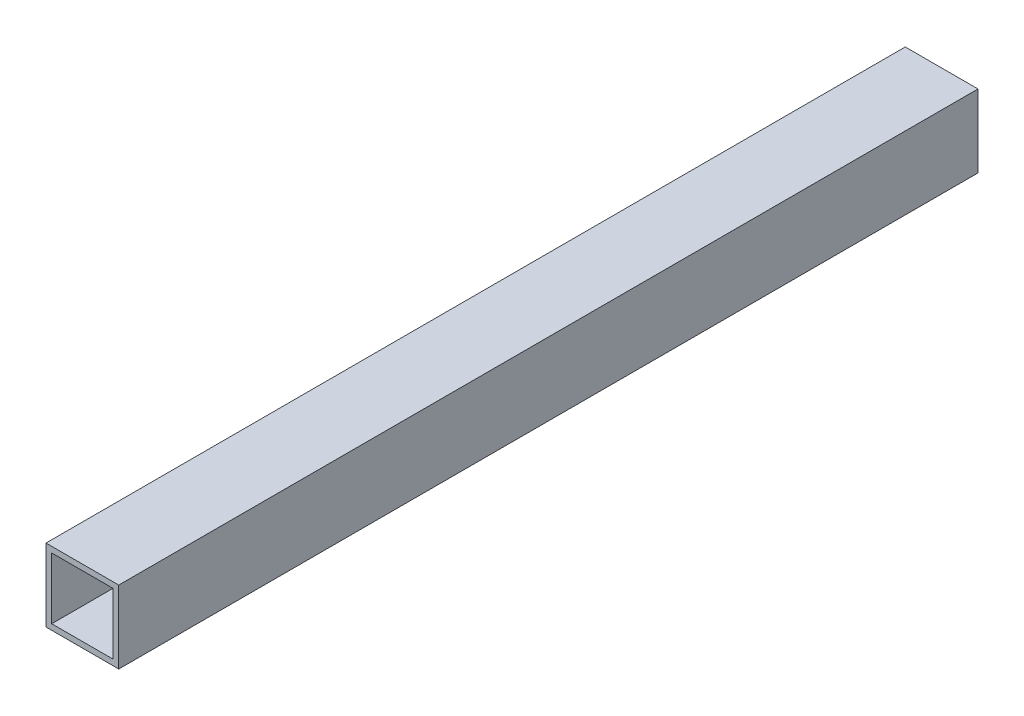
ISO-10303-21;
HEADER;
FILE_DESCRIPTION(('STEP AP214'),'2;1');
FILE_NAME('part.step','',(''),(''),'','','');
FILE_SCHEMA(('AUTOMOTIVE_DESIGN { 1 0 10303 214 1 1 1 1 }'));
ENDSEC;
DATA;
#1=APPLICATION_CONTEXT('core data for automotive mechanical design processes');
#2=APPLICATION_PROTOCOL_DEFINITION('international standard','automotive_design',2000,#1);
#3=PRODUCT_CONTEXT('',#1,'mechanical');
#4=PRODUCT('Part','Part','',(#3));
#5=PRODUCT_RELATED_PRODUCT_CATEGORY('part','',(#4));
#6=PRODUCT_DEFINITION_FORMATION('','',#4);
#7=PRODUCT_DEFINITION_CONTEXT('part definition',#1,'design');
#8=PRODUCT_DEFINITION('design','',#6,#7);
#9=PRODUCT_DEFINITION_SHAPE('','',#8);
#10=(LENGTH_UNIT() NAMED_UNIT(*) SI_UNIT(.MILLI.,.METRE.));
#11=(NAMED_UNIT(*) PLANE_ANGLE_UNIT() SI_UNIT($,.RADIAN.));
#12=(NAMED_UNIT(*) SI_UNIT($,.STERADIAN.) SOLID_ANGLE_UNIT());
#13=UNCERTAINTY_MEASURE_WITH_UNIT(LENGTH_MEASURE(1.E-05),#10,'distance_accuracy_value','');
#14=(GEOMETRIC_REPRESENTATION_CONTEXT(3) GLOBAL_UNCERTAINTY_ASSIGNED_CONTEXT((#13)) GLOBAL_UNIT_ASSIGNED_CONTEXT((#10,
#11,#12)) REPRESENTATION_CONTEXT('',''));
#15=CARTESIAN_POINT('',(0.,0.,0.));
#16=DIRECTION('',(0.,0.,1.));
#17=DIRECTION('',(1.,0.,0.));
#18=AXIS2_PLACEMENT_3D('',#15,#16,#17);
#19=CARTESIAN_POINT('',(0.,0.,300.));
#20=DIRECTION('',(0.,0.,-1.));
#21=DIRECTION('',(-1.,0.,0.));
#22=AXIS2_PLACEMENT_3D('',#19,#20,#21);
#23=PLANE('',#22);
#24=DIRECTION('',(0.,1.,0.));
#25=VECTOR('',#24,1.);
#26=CARTESIAN_POINT('',(12.7,-12.7,300.));
#27=LINE('',#26,#25);
#28=CARTESIAN_POINT('',(12.7,-12.7,300.));
#29=VERTEX_POINT('',#28);
#30=CARTESIAN_POINT('',(12.7,12.7,300.));
#31=VERTEX_POINT('',#30);
#32=EDGE_CURVE('E157',#29,#31,#27,.T.);
#33=ORIENTED_EDGE('',*,*,#32,.T.);
#34=DIRECTION('',(-1.,0.,0.));
#35=VECTOR('',#34,1.);
#36=CARTESIAN_POINT('',(-12.7,12.7,300.));
#37=LINE('',#36,#35);
#38=CARTESIAN_POINT('',(-12.7,12.7,300.));
#39=VERTEX_POINT('',#38);
#40=EDGE_CURVE('E161',#31,#39,#37,.T.);
#41=ORIENTED_EDGE('',*,*,#40,.T.);
#42=DIRECTION('',(0.,-1.,0.));
#43=VECTOR('',#42,1.);
#44=CARTESIAN_POINT('',(-12.7,-12.7,300.));
#45=LINE('',#44,#43);
#46=CARTESIAN_POINT('',(-12.7,-12.7,300.));
#47=VERTEX_POINT('',#46);
#48=EDGE_CURVE('E165',#39,#47,#45,.T.);
#49=ORIENTED_EDGE('',*,*,#48,.T.);
#50=DIRECTION('',(1.,0.,0.));
#51=VECTOR('',#50,1.);
#52=CARTESIAN_POINT('',(-12.7,-12.7,300.));
#53=LINE('',#52,#51);
#54=EDGE_CURVE('E168',#47,#29,#53,.T.);
#55=ORIENTED_EDGE('',*,*,#54,.T.);
#56=EDGE_LOOP('',(#33,#41,#49,#55));
#57=FACE_BOUND('',#56,.T.);
#58=DIRECTION('',(0.,-1.,0.));
#59=VECTOR('',#58,1.);
#60=CARTESIAN_POINT('',(-10.7,-10.7,300.));
#61=LINE('',#60,#59);
#62=CARTESIAN_POINT('',(-10.7,10.7,300.));
#63=VERTEX_POINT('',#62);
#64=CARTESIAN_POINT('',(-10.7,-10.7,300.));
#65=VERTEX_POINT('',#64);
#66=EDGE_CURVE('E109',#63,#65,#61,.T.);
#67=ORIENTED_EDGE('',*,*,#66,.F.);
#68=DIRECTION('',(-1.,0.,0.));
#69=VECTOR('',#68,1.);
#70=CARTESIAN_POINT('',(-10.7,10.7,300.));
#71=LINE('',#70,#69);
#72=CARTESIAN_POINT('',(10.7,10.7,300.));
#73=VERTEX_POINT('',#72);
#74=EDGE_CURVE('E135',#73,#63,#71,.T.);
#75=ORIENTED_EDGE('',*,*,#74,.F.);
#76=DIRECTION('',(0.,1.,0.));
#77=VECTOR('',#76,1.);
#78=CARTESIAN_POINT('',(10.7,-10.7,300.));
#79=LINE('',#78,#77);
#80=CARTESIAN_POINT('',(10.7,-10.7,300.));
#81=VERTEX_POINT('',#80);
#82=EDGE_CURVE('E131',#81,#73,#79,.T.);
#83=ORIENTED_EDGE('',*,*,#82,.F.);
#84=DIRECTION('',(1.,0.,0.));
#85=VECTOR('',#84,1.);
#86=CARTESIAN_POINT('',(-10.7,-10.7,300.));
#87=LINE('',#86,#85);
#88=EDGE_CURVE('E118',#65,#81,#87,.T.);
#89=ORIENTED_EDGE('',*,*,#88,.F.);
#90=EDGE_LOOP('',(#67,#75,#83,#89));
#91=FACE_BOUND('',#90,.T.);
#92=ADVANCED_FACE('F43',(#57,#91),#23,.F.);
#93=CARTESIAN_POINT('',(0.,0.,0.));
#94=DIRECTION('',(0.,0.,-1.));
#95=DIRECTION('',(-1.,0.,0.));
#96=AXIS2_PLACEMENT_3D('',#93,#94,#95);
#97=PLANE('',#96);
#98=DIRECTION('',(0.,1.,0.));
#99=VECTOR('',#98,1.);
#100=CARTESIAN_POINT('',(12.7,-12.7,0.));
#101=LINE('',#100,#99);
#102=CARTESIAN_POINT('',(12.7,-12.7,0.));
#103=VERTEX_POINT('',#102);
#104=CARTESIAN_POINT('',(12.7,12.7,0.));
#105=VERTEX_POINT('',#104);
#106=EDGE_CURVE('E127',#103,#105,#101,.T.);
#107=ORIENTED_EDGE('',*,*,#106,.F.);
#108=DIRECTION('',(1.,0.,0.));
#109=VECTOR('',#108,1.);
#110=CARTESIAN_POINT('',(-12.7,-12.7,0.));
#111=LINE('',#110,#109);
#112=CARTESIAN_POINT('',(-12.7,-12.7,0.));
#113=VERTEX_POINT('',#112);
#114=EDGE_CURVE('E162',#113,#103,#111,.T.);
#115=ORIENTED_EDGE('',*,*,#114,.F.);
#116=DIRECTION('',(0.,-1.,0.));
#117=VECTOR('',#116,1.);
#118=CARTESIAN_POINT('',(-12.7,-12.7,0.));
#119=LINE('',#118,#117);
#120=CARTESIAN_POINT('',(-12.7,12.7,0.));
#121=VERTEX_POINT('',#120);
#122=EDGE_CURVE('E178',#121,#113,#119,.T.);
#123=ORIENTED_EDGE('',*,*,#122,.F.);
#124=DIRECTION('',(-1.,0.,0.));
#125=VECTOR('',#124,1.);
#126=CARTESIAN_POINT('',(-12.7,12.7,0.));
#127=LINE('',#126,#125);
#128=EDGE_CURVE('E175',#105,#121,#127,.T.);
#129=ORIENTED_EDGE('',*,*,#128,.F.);
#130=EDGE_LOOP('',(#107,#115,#123,#129));
#131=FACE_BOUND('',#130,.T.);
#132=DIRECTION('',(-1.,0.,0.));
#133=VECTOR('',#132,1.);
#134=CARTESIAN_POINT('',(-10.7,10.7,0.));
#135=LINE('',#134,#133);
#136=CARTESIAN_POINT('',(10.7,10.7,0.));
#137=VERTEX_POINT('',#136);
#138=CARTESIAN_POINT('',(-10.7,10.7,0.));
#139=VERTEX_POINT('',#138);
#140=EDGE_CURVE('E119',#137,#139,#135,.T.);
#141=ORIENTED_EDGE('',*,*,#140,.T.);
#142=DIRECTION('',(0.,-1.,0.));
#143=VECTOR('',#142,1.);
#144=CARTESIAN_POINT('',(-10.7,-10.7,0.));
#145=LINE('',#144,#143);
#146=CARTESIAN_POINT('',(-10.7,-10.7,0.));
#147=VERTEX_POINT('',#146);
#148=EDGE_CURVE('E67',#139,#147,#145,.T.);
#149=ORIENTED_EDGE('',*,*,#148,.T.);
#150=DIRECTION('',(1.,0.,0.));
#151=VECTOR('',#150,1.);
#152=CARTESIAN_POINT('',(-10.7,-10.7,0.));
#153=LINE('',#152,#151);
#154=CARTESIAN_POINT('',(10.7,-10.7,0.));
#155=VERTEX_POINT('',#154);
#156=EDGE_CURVE('E125',#147,#155,#153,.T.);
#157=ORIENTED_EDGE('',*,*,#156,.T.);
#158=DIRECTION('',(0.,1.,0.));
#159=VECTOR('',#158,1.);
#160=CARTESIAN_POINT('',(10.7,-10.7,0.));
#161=LINE('',#160,#159);
#162=EDGE_CURVE('E144',#155,#137,#161,.T.);
#163=ORIENTED_EDGE('',*,*,#162,.T.);
#164=EDGE_LOOP('',(#141,#149,#157,#163));
#165=FACE_BOUND('',#164,.T.);
#166=ADVANCED_FACE('F201',(#131,#165),#97,.T.);
#167=CARTESIAN_POINT('',(12.7,-12.7,300.));
#168=DIRECTION('',(-1.,0.,0.));
#169=DIRECTION('',(0.,0.,1.));
#170=AXIS2_PLACEMENT_3D('',#167,#168,#169);
#171=PLANE('',#170);
#172=ORIENTED_EDGE('',*,*,#106,.T.);
#173=DIRECTION('',(0.,0.,-1.));
#174=VECTOR('',#173,1.);
#175=CARTESIAN_POINT('',(12.7,12.7,300.));
#176=LINE('',#175,#174);
#177=EDGE_CURVE('E11',#31,#105,#176,.T.);
#178=ORIENTED_EDGE('',*,*,#177,.F.);
#179=ORIENTED_EDGE('',*,*,#32,.F.);
#180=DIRECTION('',(0.,0.,-1.));
#181=VECTOR('',#180,1.);
#182=CARTESIAN_POINT('',(12.7,-12.7,300.));
#183=LINE('',#182,#181);
#184=EDGE_CURVE('E171',#29,#103,#183,.T.);
#185=ORIENTED_EDGE('',*,*,#184,.T.);
#186=EDGE_LOOP('',(#172,#178,#179,#185));
#187=FACE_BOUND('',#186,.T.);
#188=ADVANCED_FACE('F45',(#187),#171,.F.);
#189=CARTESIAN_POINT('',(-12.7,12.7,300.));
#190=DIRECTION('',(0.,-1.,0.));
#191=DIRECTION('',(0.,0.,-1.));
#192=AXIS2_PLACEMENT_3D('',#189,#190,#191);
#193=PLANE('',#192);
#194=ORIENTED_EDGE('',*,*,#128,.T.);
#195=DIRECTION('',(0.,0.,-1.));
#196=VECTOR('',#195,1.);
#197=CARTESIAN_POINT('',(-12.7,12.7,300.));
#198=LINE('',#197,#196);
#199=EDGE_CURVE('E52',#39,#121,#198,.T.);
#200=ORIENTED_EDGE('',*,*,#199,.F.);
#201=ORIENTED_EDGE('',*,*,#40,.F.);
#202=ORIENTED_EDGE('',*,*,#177,.T.);
#203=EDGE_LOOP('',(#194,#200,#201,#202));
#204=FACE_BOUND('',#203,.T.);
#205=ADVANCED_FACE('F211',(#204),#193,.F.);
#206=CARTESIAN_POINT('',(-12.7,-12.7,300.));
#207=DIRECTION('',(1.,0.,0.));
#208=DIRECTION('',(0.,0.,-1.));
#209=AXIS2_PLACEMENT_3D('',#206,#207,#208);
#210=PLANE('',#209);
#211=ORIENTED_EDGE('',*,*,#122,.T.);
#212=DIRECTION('',(0.,0.,-1.));
#213=VECTOR('',#212,1.);
#214=CARTESIAN_POINT('',(-12.7,-12.7,300.));
#215=LINE('',#214,#213);
#216=EDGE_CURVE('E186',#47,#113,#215,.T.);
#217=ORIENTED_EDGE('',*,*,#216,.F.);
#218=ORIENTED_EDGE('',*,*,#48,.F.);
#219=ORIENTED_EDGE('',*,*,#199,.T.);
#220=EDGE_LOOP('',(#211,#217,#218,#219));
#221=FACE_BOUND('',#220,.T.);
#222=ADVANCED_FACE('F195',(#221),#210,.F.);
#223=CARTESIAN_POINT('',(-12.7,-12.7,300.));
#224=DIRECTION('',(0.,1.,0.));
#225=DIRECTION('',(0.,0.,1.));
#226=AXIS2_PLACEMENT_3D('',#223,#224,#225);
#227=PLANE('',#226);
#228=ORIENTED_EDGE('',*,*,#114,.T.);
#229=ORIENTED_EDGE('',*,*,#184,.F.);
#230=ORIENTED_EDGE('',*,*,#54,.F.);
#231=ORIENTED_EDGE('',*,*,#216,.T.);
#232=EDGE_LOOP('',(#228,#229,#230,#231));
#233=FACE_BOUND('',#232,.T.);
#234=ADVANCED_FACE('F205',(#233),#227,.F.);
#235=CARTESIAN_POINT('',(-10.7,-10.7,300.));
#236=DIRECTION('',(1.,0.,0.));
#237=DIRECTION('',(0.,0.,-1.));
#238=AXIS2_PLACEMENT_3D('',#235,#236,#237);
#239=PLANE('',#238);
#240=ORIENTED_EDGE('',*,*,#148,.F.);
#241=DIRECTION('',(0.,0.,-1.));
#242=VECTOR('',#241,1.);
#243=CARTESIAN_POINT('',(-10.7,10.7,300.));
#244=LINE('',#243,#242);
#245=EDGE_CURVE('E113',#63,#139,#244,.T.);
#246=ORIENTED_EDGE('',*,*,#245,.F.);
#247=ORIENTED_EDGE('',*,*,#66,.T.);
#248=DIRECTION('',(0.,0.,-1.));
#249=VECTOR('',#248,1.);
#250=CARTESIAN_POINT('',(-10.7,-10.7,300.));
#251=LINE('',#250,#249);
#252=EDGE_CURVE('E112',#65,#147,#251,.T.);
#253=ORIENTED_EDGE('',*,*,#252,.T.);
#254=EDGE_LOOP('',(#240,#246,#247,#253));
#255=FACE_BOUND('',#254,.T.);
#256=ADVANCED_FACE('F111',(#255),#239,.T.);
#257=CARTESIAN_POINT('',(-10.7,-10.7,300.));
#258=DIRECTION('',(0.,1.,0.));
#259=DIRECTION('',(0.,0.,1.));
#260=AXIS2_PLACEMENT_3D('',#257,#258,#259);
#261=PLANE('',#260);
#262=ORIENTED_EDGE('',*,*,#156,.F.);
#263=ORIENTED_EDGE('',*,*,#252,.F.);
#264=ORIENTED_EDGE('',*,*,#88,.T.);
#265=DIRECTION('',(0.,0.,-1.));
#266=VECTOR('',#265,1.);
#267=CARTESIAN_POINT('',(10.7,-10.7,300.));
#268=LINE('',#267,#266);
#269=EDGE_CURVE('E128',#81,#155,#268,.T.);
#270=ORIENTED_EDGE('',*,*,#269,.T.);
#271=EDGE_LOOP('',(#262,#263,#264,#270));
#272=FACE_BOUND('',#271,.T.);
#273=ADVANCED_FACE('F122',(#272),#261,.T.);
#274=CARTESIAN_POINT('',(10.7,-10.7,300.));
#275=DIRECTION('',(-1.,0.,0.));
#276=DIRECTION('',(0.,-1.,0.));
#277=AXIS2_PLACEMENT_3D('',#274,#275,#276);
#278=PLANE('',#277);
#279=ORIENTED_EDGE('',*,*,#162,.F.);
#280=ORIENTED_EDGE('',*,*,#269,.F.);
#281=ORIENTED_EDGE('',*,*,#82,.T.);
#282=DIRECTION('',(0.,0.,-1.));
#283=VECTOR('',#282,1.);
#284=CARTESIAN_POINT('',(10.7,10.7,300.));
#285=LINE('',#284,#283);
#286=EDGE_CURVE('E59',#73,#137,#285,.T.);
#287=ORIENTED_EDGE('',*,*,#286,.T.);
#288=EDGE_LOOP('',(#279,#280,#281,#287));
#289=FACE_BOUND('',#288,.T.);
#290=ADVANCED_FACE('F234',(#289),#278,.T.);
#291=CARTESIAN_POINT('',(-10.7,10.7,300.));
#292=DIRECTION('',(0.,-1.,0.));
#293=DIRECTION('',(1.,0.,0.));
#294=AXIS2_PLACEMENT_3D('',#291,#292,#293);
#295=PLANE('',#294);
#296=ORIENTED_EDGE('',*,*,#140,.F.);
#297=ORIENTED_EDGE('',*,*,#286,.F.);
#298=ORIENTED_EDGE('',*,*,#74,.T.);
#299=ORIENTED_EDGE('',*,*,#245,.T.);
#300=EDGE_LOOP('',(#296,#297,#298,#299));
#301=FACE_BOUND('',#300,.T.);
#302=ADVANCED_FACE('F238',(#301),#295,.T.);
#303=CLOSED_SHELL('',(#92,#166,#188,#205,#222,#234,#256,#273,#290,#302));
#304=MANIFOLD_SOLID_BREP('B2',#303);
#305=ADVANCED_BREP_SHAPE_REPRESENTATION('',(#18,#304),#14);
#306=SHAPE_DEFINITION_REPRESENTATION(#9,#305);
ENDSEC;
END-ISO-10303-21;
